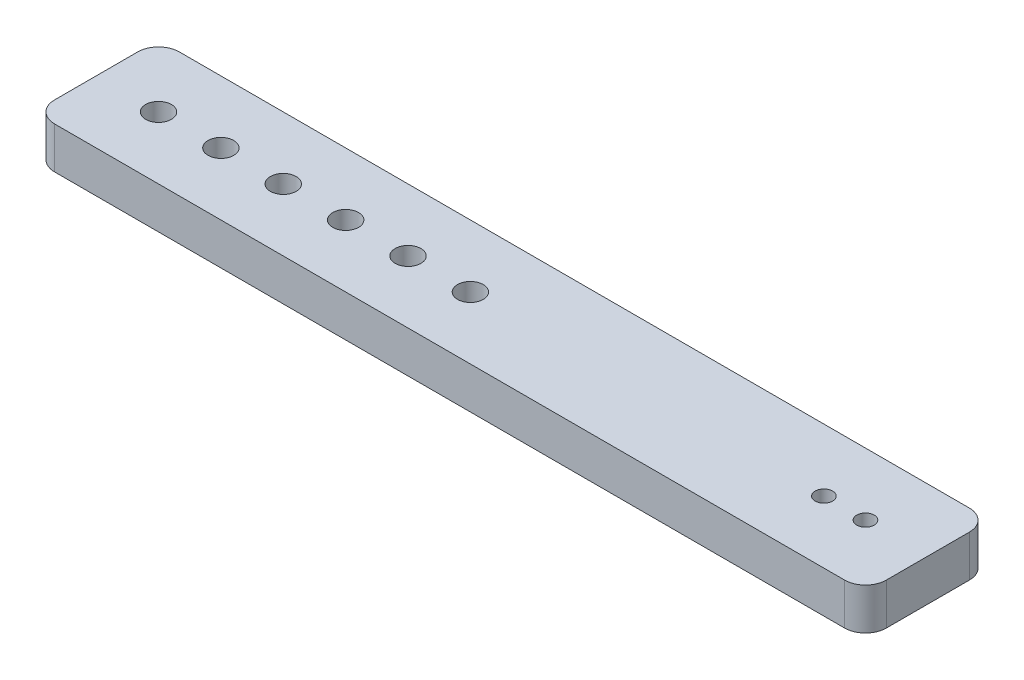
ISO-10303-21;
HEADER;
FILE_DESCRIPTION(('STEP AP214'),'2;1');
FILE_NAME('part.step','',(''),(''),'','','');
FILE_SCHEMA(('AUTOMOTIVE_DESIGN { 1 0 10303 214 1 1 1 1 }'));
ENDSEC;
DATA;
#1=APPLICATION_CONTEXT('core data for automotive mechanical design processes');
#2=APPLICATION_PROTOCOL_DEFINITION('international standard','automotive_design',2000,#1);
#3=PRODUCT_CONTEXT('',#1,'mechanical');
#4=PRODUCT('Part','Part','',(#3));
#5=PRODUCT_RELATED_PRODUCT_CATEGORY('part','',(#4));
#6=PRODUCT_DEFINITION_FORMATION('','',#4);
#7=PRODUCT_DEFINITION_CONTEXT('part definition',#1,'design');
#8=PRODUCT_DEFINITION('design','',#6,#7);
#9=PRODUCT_DEFINITION_SHAPE('','',#8);
#10=(LENGTH_UNIT() NAMED_UNIT(*) SI_UNIT(.MILLI.,.METRE.));
#11=(NAMED_UNIT(*) PLANE_ANGLE_UNIT() SI_UNIT($,.RADIAN.));
#12=(NAMED_UNIT(*) SI_UNIT($,.STERADIAN.) SOLID_ANGLE_UNIT());
#13=UNCERTAINTY_MEASURE_WITH_UNIT(LENGTH_MEASURE(1.E-05),#10,'distance_accuracy_value','');
#14=(GEOMETRIC_REPRESENTATION_CONTEXT(3) GLOBAL_UNCERTAINTY_ASSIGNED_CONTEXT((#13)) GLOBAL_UNIT_ASSIGNED_CONTEXT((#10,
#11,#12)) REPRESENTATION_CONTEXT('',''));
#15=CARTESIAN_POINT('',(0.,0.,0.));
#16=DIRECTION('',(0.,0.,1.));
#17=DIRECTION('',(1.,0.,0.));
#18=AXIS2_PLACEMENT_3D('',#15,#16,#17);
#19=CARTESIAN_POINT('',(-10.,0.,0.));
#20=DIRECTION('',(0.,1.,0.));
#21=DIRECTION('',(0.,0.,1.));
#22=AXIS2_PLACEMENT_3D('',#19,#20,#21);
#23=CYLINDRICAL_SURFACE('',#22,3.1);
#24=CARTESIAN_POINT('',(-10.,0.,0.));
#25=DIRECTION('',(0.,1.,0.));
#26=DIRECTION('',(0.,0.,1.));
#27=AXIS2_PLACEMENT_3D('',#24,#25,#26);
#28=CIRCLE('',#27,3.1);
#29=CARTESIAN_POINT('',(-10.,0.,3.1));
#30=VERTEX_POINT('',#29);
#31=EDGE_CURVE('E154',#30,#30,#28,.T.);
#32=ORIENTED_EDGE('',*,*,#31,.F.);
#33=EDGE_LOOP('',(#32));
#34=FACE_BOUND('',#33,.T.);
#35=CARTESIAN_POINT('',(-10.,10.,0.));
#36=DIRECTION('',(0.,1.,0.));
#37=DIRECTION('',(0.,0.,1.));
#38=AXIS2_PLACEMENT_3D('',#35,#36,#37);
#39=CIRCLE('',#38,3.1);
#40=CARTESIAN_POINT('',(-10.,10.,3.1));
#41=VERTEX_POINT('',#40);
#42=EDGE_CURVE('E157',#41,#41,#39,.T.);
#43=ORIENTED_EDGE('',*,*,#42,.T.);
#44=EDGE_LOOP('',(#43));
#45=FACE_BOUND('',#44,.T.);
#46=ADVANCED_FACE('F32',(#34,#45),#23,.F.);
#47=CARTESIAN_POINT('',(-25.,0.,0.));
#48=DIRECTION('',(0.,1.,0.));
#49=DIRECTION('',(0.,0.,1.));
#50=AXIS2_PLACEMENT_3D('',#47,#48,#49);
#51=CYLINDRICAL_SURFACE('',#50,3.1);
#52=CARTESIAN_POINT('',(-25.,0.,0.));
#53=DIRECTION('',(0.,1.,0.));
#54=DIRECTION('',(0.,0.,1.));
#55=AXIS2_PLACEMENT_3D('',#52,#53,#54);
#56=CIRCLE('',#55,3.1);
#57=CARTESIAN_POINT('',(-25.,0.,3.1));
#58=VERTEX_POINT('',#57);
#59=EDGE_CURVE('E148',#58,#58,#56,.T.);
#60=ORIENTED_EDGE('',*,*,#59,.F.);
#61=EDGE_LOOP('',(#60));
#62=FACE_BOUND('',#61,.T.);
#63=CARTESIAN_POINT('',(-25.,10.,0.));
#64=DIRECTION('',(0.,1.,0.));
#65=DIRECTION('',(0.,0.,1.));
#66=AXIS2_PLACEMENT_3D('',#63,#64,#65);
#67=CIRCLE('',#66,3.1);
#68=CARTESIAN_POINT('',(-25.,10.,3.1));
#69=VERTEX_POINT('',#68);
#70=EDGE_CURVE('E151',#69,#69,#67,.T.);
#71=ORIENTED_EDGE('',*,*,#70,.T.);
#72=EDGE_LOOP('',(#71));
#73=FACE_BOUND('',#72,.T.);
#74=ADVANCED_FACE('F255',(#62,#73),#51,.F.);
#75=CARTESIAN_POINT('',(-40.,0.,0.));
#76=DIRECTION('',(0.,1.,0.));
#77=DIRECTION('',(0.,0.,1.));
#78=AXIS2_PLACEMENT_3D('',#75,#76,#77);
#79=CYLINDRICAL_SURFACE('',#78,3.1);
#80=CARTESIAN_POINT('',(-40.,0.,0.));
#81=DIRECTION('',(0.,1.,0.));
#82=DIRECTION('',(0.,0.,1.));
#83=AXIS2_PLACEMENT_3D('',#80,#81,#82);
#84=CIRCLE('',#83,3.1);
#85=CARTESIAN_POINT('',(-40.,0.,3.1));
#86=VERTEX_POINT('',#85);
#87=EDGE_CURVE('E142',#86,#86,#84,.T.);
#88=ORIENTED_EDGE('',*,*,#87,.F.);
#89=EDGE_LOOP('',(#88));
#90=FACE_BOUND('',#89,.T.);
#91=CARTESIAN_POINT('',(-40.,10.,0.));
#92=DIRECTION('',(0.,1.,0.));
#93=DIRECTION('',(0.,0.,1.));
#94=AXIS2_PLACEMENT_3D('',#91,#92,#93);
#95=CIRCLE('',#94,3.1);
#96=CARTESIAN_POINT('',(-40.,10.,3.1));
#97=VERTEX_POINT('',#96);
#98=EDGE_CURVE('E145',#97,#97,#95,.T.);
#99=ORIENTED_EDGE('',*,*,#98,.T.);
#100=EDGE_LOOP('',(#99));
#101=FACE_BOUND('',#100,.T.);
#102=ADVANCED_FACE('F261',(#90,#101),#79,.F.);
#103=CARTESIAN_POINT('',(-55.,0.,0.));
#104=DIRECTION('',(0.,1.,0.));
#105=DIRECTION('',(0.,0.,1.));
#106=AXIS2_PLACEMENT_3D('',#103,#104,#105);
#107=CYLINDRICAL_SURFACE('',#106,3.1);
#108=CARTESIAN_POINT('',(-55.,0.,0.));
#109=DIRECTION('',(0.,1.,0.));
#110=DIRECTION('',(0.,0.,1.));
#111=AXIS2_PLACEMENT_3D('',#108,#109,#110);
#112=CIRCLE('',#111,3.1);
#113=CARTESIAN_POINT('',(-55.,0.,3.1));
#114=VERTEX_POINT('',#113);
#115=EDGE_CURVE('E136',#114,#114,#112,.T.);
#116=ORIENTED_EDGE('',*,*,#115,.F.);
#117=EDGE_LOOP('',(#116));
#118=FACE_BOUND('',#117,.T.);
#119=CARTESIAN_POINT('',(-55.,10.,0.));
#120=DIRECTION('',(0.,1.,0.));
#121=DIRECTION('',(0.,0.,1.));
#122=AXIS2_PLACEMENT_3D('',#119,#120,#121);
#123=CIRCLE('',#122,3.1);
#124=CARTESIAN_POINT('',(-55.,10.,3.1));
#125=VERTEX_POINT('',#124);
#126=EDGE_CURVE('E139',#125,#125,#123,.T.);
#127=ORIENTED_EDGE('',*,*,#126,.T.);
#128=EDGE_LOOP('',(#127));
#129=FACE_BOUND('',#128,.T.);
#130=ADVANCED_FACE('F295',(#118,#129),#107,.F.);
#131=CARTESIAN_POINT('',(-100.,10.,15.));
#132=DIRECTION('',(1.,0.,0.));
#133=DIRECTION('',(0.,0.,-1.));
#134=AXIS2_PLACEMENT_3D('',#131,#132,#133);
#135=PLANE('',#134);
#136=DIRECTION('',(0.,0.,1.));
#137=VECTOR('',#136,1.);
#138=CARTESIAN_POINT('',(-100.,10.,15.));
#139=LINE('',#138,#137);
#140=CARTESIAN_POINT('',(-100.,10.,-10.));
#141=VERTEX_POINT('',#140);
#142=CARTESIAN_POINT('',(-100.,10.,10.));
#143=VERTEX_POINT('',#142);
#144=EDGE_CURVE('E127',#141,#143,#139,.T.);
#145=ORIENTED_EDGE('',*,*,#144,.F.);
#146=DIRECTION('',(0.,-1.,0.));
#147=VECTOR('',#146,1.);
#148=CARTESIAN_POINT('',(-100.,10.,-10.));
#149=LINE('',#148,#147);
#150=CARTESIAN_POINT('',(-100.,0.,-10.));
#151=VERTEX_POINT('',#150);
#152=EDGE_CURVE('E11',#141,#151,#149,.T.);
#153=ORIENTED_EDGE('',*,*,#152,.T.);
#154=DIRECTION('',(0.,0.,1.));
#155=VECTOR('',#154,1.);
#156=CARTESIAN_POINT('',(-100.,0.,15.));
#157=LINE('',#156,#155);
#158=CARTESIAN_POINT('',(-100.,0.,10.));
#159=VERTEX_POINT('',#158);
#160=EDGE_CURVE('E183',#151,#159,#157,.T.);
#161=ORIENTED_EDGE('',*,*,#160,.T.);
#162=DIRECTION('',(0.,-1.,0.));
#163=VECTOR('',#162,1.);
#164=CARTESIAN_POINT('',(-100.,10.,10.));
#165=LINE('',#164,#163);
#166=EDGE_CURVE('E40',#159,#143,#165,.F.);
#167=ORIENTED_EDGE('',*,*,#166,.T.);
#168=EDGE_LOOP('',(#145,#153,#161,#167));
#169=FACE_BOUND('',#168,.T.);
#170=ADVANCED_FACE('F181',(#169),#135,.F.);
#171=CARTESIAN_POINT('',(100.,10.,15.));
#172=DIRECTION('',(0.,0.,-1.));
#173=DIRECTION('',(-1.,0.,0.));
#174=AXIS2_PLACEMENT_3D('',#171,#172,#173);
#175=PLANE('',#174);
#176=DIRECTION('',(1.,0.,0.));
#177=VECTOR('',#176,1.);
#178=CARTESIAN_POINT('',(100.,0.,15.));
#179=LINE('',#178,#177);
#180=CARTESIAN_POINT('',(-95.,0.,15.));
#181=VERTEX_POINT('',#180);
#182=CARTESIAN_POINT('',(95.,0.,15.));
#183=VERTEX_POINT('',#182);
#184=EDGE_CURVE('E132',#181,#183,#179,.T.);
#185=ORIENTED_EDGE('',*,*,#184,.T.);
#186=DIRECTION('',(0.,-1.,0.));
#187=VECTOR('',#186,1.);
#188=CARTESIAN_POINT('',(95.,10.,15.));
#189=LINE('',#188,#187);
#190=CARTESIAN_POINT('',(95.,10.,15.));
#191=VERTEX_POINT('',#190);
#192=EDGE_CURVE('E47',#183,#191,#189,.F.);
#193=ORIENTED_EDGE('',*,*,#192,.T.);
#194=DIRECTION('',(1.,0.,0.));
#195=VECTOR('',#194,1.);
#196=CARTESIAN_POINT('',(100.,10.,15.));
#197=LINE('',#196,#195);
#198=CARTESIAN_POINT('',(-95.,10.,15.));
#199=VERTEX_POINT('',#198);
#200=EDGE_CURVE('E130',#199,#191,#197,.T.);
#201=ORIENTED_EDGE('',*,*,#200,.F.);
#202=DIRECTION('',(0.,-1.,0.));
#203=VECTOR('',#202,1.);
#204=CARTESIAN_POINT('',(-95.,10.,15.));
#205=LINE('',#204,#203);
#206=EDGE_CURVE('E174',#199,#181,#205,.T.);
#207=ORIENTED_EDGE('',*,*,#206,.T.);
#208=EDGE_LOOP('',(#185,#193,#201,#207));
#209=FACE_BOUND('',#208,.T.);
#210=ADVANCED_FACE('F191',(#209),#175,.F.);
#211=CARTESIAN_POINT('',(100.,10.,15.));
#212=DIRECTION('',(-1.,0.,0.));
#213=DIRECTION('',(0.,0.,1.));
#214=AXIS2_PLACEMENT_3D('',#211,#212,#213);
#215=PLANE('',#214);
#216=DIRECTION('',(0.,0.,-1.));
#217=VECTOR('',#216,1.);
#218=CARTESIAN_POINT('',(100.,0.,15.));
#219=LINE('',#218,#217);
#220=CARTESIAN_POINT('',(100.,0.,10.));
#221=VERTEX_POINT('',#220);
#222=CARTESIAN_POINT('',(100.,0.,-10.));
#223=VERTEX_POINT('',#222);
#224=EDGE_CURVE('E128',#221,#223,#219,.T.);
#225=ORIENTED_EDGE('',*,*,#224,.T.);
#226=DIRECTION('',(0.,-1.,0.));
#227=VECTOR('',#226,1.);
#228=CARTESIAN_POINT('',(100.,10.,-10.));
#229=LINE('',#228,#227);
#230=CARTESIAN_POINT('',(100.,10.,-10.));
#231=VERTEX_POINT('',#230);
#232=EDGE_CURVE('E104',#223,#231,#229,.F.);
#233=ORIENTED_EDGE('',*,*,#232,.T.);
#234=DIRECTION('',(0.,0.,-1.));
#235=VECTOR('',#234,1.);
#236=CARTESIAN_POINT('',(100.,10.,15.));
#237=LINE('',#236,#235);
#238=CARTESIAN_POINT('',(100.,10.,10.));
#239=VERTEX_POINT('',#238);
#240=EDGE_CURVE('E196',#239,#231,#237,.T.);
#241=ORIENTED_EDGE('',*,*,#240,.F.);
#242=DIRECTION('',(0.,-1.,0.));
#243=VECTOR('',#242,1.);
#244=CARTESIAN_POINT('',(100.,10.,10.));
#245=LINE('',#244,#243);
#246=EDGE_CURVE('E109',#239,#221,#245,.T.);
#247=ORIENTED_EDGE('',*,*,#246,.T.);
#248=EDGE_LOOP('',(#225,#233,#241,#247));
#249=FACE_BOUND('',#248,.T.);
#250=ADVANCED_FACE('F283',(#249),#215,.F.);
#251=CARTESIAN_POINT('',(100.,10.,-15.));
#252=DIRECTION('',(0.,0.,1.));
#253=DIRECTION('',(1.,0.,0.));
#254=AXIS2_PLACEMENT_3D('',#251,#252,#253);
#255=PLANE('',#254);
#256=DIRECTION('',(-1.,0.,0.));
#257=VECTOR('',#256,1.);
#258=CARTESIAN_POINT('',(100.,10.,-15.));
#259=LINE('',#258,#257);
#260=CARTESIAN_POINT('',(95.,10.,-15.));
#261=VERTEX_POINT('',#260);
#262=CARTESIAN_POINT('',(-95.,10.,-15.));
#263=VERTEX_POINT('',#262);
#264=EDGE_CURVE('E119',#261,#263,#259,.T.);
#265=ORIENTED_EDGE('',*,*,#264,.F.);
#266=DIRECTION('',(0.,-1.,0.));
#267=VECTOR('',#266,1.);
#268=CARTESIAN_POINT('',(95.,10.,-15.));
#269=LINE('',#268,#267);
#270=CARTESIAN_POINT('',(95.,0.,-15.));
#271=VERTEX_POINT('',#270);
#272=EDGE_CURVE('E103',#261,#271,#269,.T.);
#273=ORIENTED_EDGE('',*,*,#272,.T.);
#274=DIRECTION('',(-1.,0.,0.));
#275=VECTOR('',#274,1.);
#276=CARTESIAN_POINT('',(100.,0.,-15.));
#277=LINE('',#276,#275);
#278=CARTESIAN_POINT('',(-95.,0.,-15.));
#279=VERTEX_POINT('',#278);
#280=EDGE_CURVE('E116',#271,#279,#277,.T.);
#281=ORIENTED_EDGE('',*,*,#280,.T.);
#282=DIRECTION('',(0.,-1.,0.));
#283=VECTOR('',#282,1.);
#284=CARTESIAN_POINT('',(-95.,10.,-15.));
#285=LINE('',#284,#283);
#286=EDGE_CURVE('E121',#279,#263,#285,.F.);
#287=ORIENTED_EDGE('',*,*,#286,.T.);
#288=EDGE_LOOP('',(#265,#273,#281,#287));
#289=FACE_BOUND('',#288,.T.);
#290=ADVANCED_FACE('F115',(#289),#255,.F.);
#291=CARTESIAN_POINT('',(0.,10.,0.));
#292=DIRECTION('',(0.,1.,0.));
#293=DIRECTION('',(0.,0.,1.));
#294=AXIS2_PLACEMENT_3D('',#291,#292,#293);
#295=PLANE('',#294);
#296=CARTESIAN_POINT('',(-70.,10.,0.));
#297=DIRECTION('',(0.,1.,0.));
#298=DIRECTION('',(0.,0.,1.));
#299=AXIS2_PLACEMENT_3D('',#296,#297,#298);
#300=CIRCLE('',#299,3.1);
#301=CARTESIAN_POINT('',(-70.,10.,3.1));
#302=VERTEX_POINT('',#301);
#303=EDGE_CURVE('E214',#302,#302,#300,.T.);
#304=ORIENTED_EDGE('',*,*,#303,.F.);
#305=EDGE_LOOP('',(#304));
#306=FACE_BOUND('',#305,.T.);
#307=CARTESIAN_POINT('',(-85.,10.,0.));
#308=DIRECTION('',(0.,1.,0.));
#309=DIRECTION('',(0.,0.,1.));
#310=AXIS2_PLACEMENT_3D('',#307,#308,#309);
#311=CIRCLE('',#310,3.1);
#312=CARTESIAN_POINT('',(-85.,10.,3.1));
#313=VERTEX_POINT('',#312);
#314=EDGE_CURVE('E211',#313,#313,#311,.T.);
#315=ORIENTED_EDGE('',*,*,#314,.F.);
#316=EDGE_LOOP('',(#315));
#317=FACE_BOUND('',#316,.T.);
#318=CARTESIAN_POINT('',(85.,10.,0.));
#319=DIRECTION('',(0.,1.,0.));
#320=DIRECTION('',(0.,0.,1.));
#321=AXIS2_PLACEMENT_3D('',#318,#319,#320);
#322=CIRCLE('',#321,2.1);
#323=CARTESIAN_POINT('',(85.,10.,2.1));
#324=VERTEX_POINT('',#323);
#325=EDGE_CURVE('E206',#324,#324,#322,.T.);
#326=ORIENTED_EDGE('',*,*,#325,.F.);
#327=EDGE_LOOP('',(#326));
#328=FACE_BOUND('',#327,.T.);
#329=CARTESIAN_POINT('',(75.,10.,0.));
#330=DIRECTION('',(0.,1.,0.));
#331=DIRECTION('',(0.,0.,1.));
#332=AXIS2_PLACEMENT_3D('',#329,#330,#331);
#333=CIRCLE('',#332,2.09999999999999);
#334=CARTESIAN_POINT('',(75.,10.,2.09999999999999));
#335=VERTEX_POINT('',#334);
#336=EDGE_CURVE('E199',#335,#335,#333,.T.);
#337=ORIENTED_EDGE('',*,*,#336,.F.);
#338=EDGE_LOOP('',(#337));
#339=FACE_BOUND('',#338,.T.);
#340=ORIENTED_EDGE('',*,*,#240,.T.);
#341=CARTESIAN_POINT('',(95.,10.,-10.));
#342=DIRECTION('',(0.,1.,0.));
#343=DIRECTION('',(0.,0.,1.));
#344=AXIS2_PLACEMENT_3D('',#341,#342,#343);
#345=CIRCLE('',#344,5.);
#346=EDGE_CURVE('E172',#231,#261,#345,.T.);
#347=ORIENTED_EDGE('',*,*,#346,.T.);
#348=ORIENTED_EDGE('',*,*,#264,.T.);
#349=CARTESIAN_POINT('',(-95.,10.,-10.));
#350=DIRECTION('',(0.,1.,0.));
#351=DIRECTION('',(0.,0.,1.));
#352=AXIS2_PLACEMENT_3D('',#349,#350,#351);
#353=CIRCLE('',#352,5.);
#354=EDGE_CURVE('E168',#263,#141,#353,.T.);
#355=ORIENTED_EDGE('',*,*,#354,.T.);
#356=ORIENTED_EDGE('',*,*,#144,.T.);
#357=CARTESIAN_POINT('',(-95.,10.,10.));
#358=DIRECTION('',(0.,1.,0.));
#359=DIRECTION('',(0.,0.,1.));
#360=AXIS2_PLACEMENT_3D('',#357,#358,#359);
#361=CIRCLE('',#360,5.);
#362=EDGE_CURVE('E54',#143,#199,#361,.T.);
#363=ORIENTED_EDGE('',*,*,#362,.T.);
#364=ORIENTED_EDGE('',*,*,#200,.T.);
#365=CARTESIAN_POINT('',(95.,10.,10.));
#366=DIRECTION('',(0.,1.,0.));
#367=DIRECTION('',(0.,0.,1.));
#368=AXIS2_PLACEMENT_3D('',#365,#366,#367);
#369=CIRCLE('',#368,5.);
#370=EDGE_CURVE('E170',#191,#239,#369,.T.);
#371=ORIENTED_EDGE('',*,*,#370,.T.);
#372=EDGE_LOOP('',(#340,#347,#348,#355,#356,#363,#364,#371));
#373=FACE_BOUND('',#372,.T.);
#374=ORIENTED_EDGE('',*,*,#126,.F.);
#375=EDGE_LOOP('',(#374));
#376=FACE_BOUND('',#375,.T.);
#377=ORIENTED_EDGE('',*,*,#98,.F.);
#378=EDGE_LOOP('',(#377));
#379=FACE_BOUND('',#378,.T.);
#380=ORIENTED_EDGE('',*,*,#70,.F.);
#381=EDGE_LOOP('',(#380));
#382=FACE_BOUND('',#381,.T.);
#383=ORIENTED_EDGE('',*,*,#42,.F.);
#384=EDGE_LOOP('',(#383));
#385=FACE_BOUND('',#384,.T.);
#386=ADVANCED_FACE('F186',(#306,#317,#328,#339,#373,#376,#379,#382,#385),#295,.T.);
#387=CARTESIAN_POINT('',(0.,0.,0.));
#388=DIRECTION('',(0.,1.,0.));
#389=DIRECTION('',(0.,0.,1.));
#390=AXIS2_PLACEMENT_3D('',#387,#388,#389);
#391=PLANE('',#390);
#392=CARTESIAN_POINT('',(-70.,0.,0.));
#393=DIRECTION('',(0.,1.,0.));
#394=DIRECTION('',(0.,0.,1.));
#395=AXIS2_PLACEMENT_3D('',#392,#393,#394);
#396=CIRCLE('',#395,3.1);
#397=CARTESIAN_POINT('',(-70.,0.,3.1));
#398=VERTEX_POINT('',#397);
#399=EDGE_CURVE('E219',#398,#398,#396,.T.);
#400=ORIENTED_EDGE('',*,*,#399,.T.);
#401=EDGE_LOOP('',(#400));
#402=FACE_BOUND('',#401,.T.);
#403=CARTESIAN_POINT('',(-85.,0.,0.));
#404=DIRECTION('',(0.,1.,0.));
#405=DIRECTION('',(0.,0.,1.));
#406=AXIS2_PLACEMENT_3D('',#403,#404,#405);
#407=CIRCLE('',#406,3.1);
#408=CARTESIAN_POINT('',(-85.,0.,3.1));
#409=VERTEX_POINT('',#408);
#410=EDGE_CURVE('E203',#409,#409,#407,.T.);
#411=ORIENTED_EDGE('',*,*,#410,.T.);
#412=EDGE_LOOP('',(#411));
#413=FACE_BOUND('',#412,.T.);
#414=CARTESIAN_POINT('',(85.,0.,0.));
#415=DIRECTION('',(0.,1.,0.));
#416=DIRECTION('',(0.,0.,1.));
#417=AXIS2_PLACEMENT_3D('',#414,#415,#416);
#418=CIRCLE('',#417,2.1);
#419=CARTESIAN_POINT('',(85.,0.,2.1));
#420=VERTEX_POINT('',#419);
#421=EDGE_CURVE('E192',#420,#420,#418,.T.);
#422=ORIENTED_EDGE('',*,*,#421,.T.);
#423=EDGE_LOOP('',(#422));
#424=FACE_BOUND('',#423,.T.);
#425=CARTESIAN_POINT('',(75.,0.,0.));
#426=DIRECTION('',(0.,1.,0.));
#427=DIRECTION('',(0.,0.,1.));
#428=AXIS2_PLACEMENT_3D('',#425,#426,#427);
#429=CIRCLE('',#428,2.09999999999999);
#430=CARTESIAN_POINT('',(75.,0.,2.09999999999999));
#431=VERTEX_POINT('',#430);
#432=EDGE_CURVE('E202',#431,#431,#429,.T.);
#433=ORIENTED_EDGE('',*,*,#432,.T.);
#434=EDGE_LOOP('',(#433));
#435=FACE_BOUND('',#434,.T.);
#436=ORIENTED_EDGE('',*,*,#280,.F.);
#437=CARTESIAN_POINT('',(95.,0.,-10.));
#438=DIRECTION('',(0.,1.,0.));
#439=DIRECTION('',(0.,0.,1.));
#440=AXIS2_PLACEMENT_3D('',#437,#438,#439);
#441=CIRCLE('',#440,5.);
#442=EDGE_CURVE('E99',#271,#223,#441,.F.);
#443=ORIENTED_EDGE('',*,*,#442,.T.);
#444=ORIENTED_EDGE('',*,*,#224,.F.);
#445=CARTESIAN_POINT('',(95.,0.,10.));
#446=DIRECTION('',(0.,1.,0.));
#447=DIRECTION('',(0.,0.,1.));
#448=AXIS2_PLACEMENT_3D('',#445,#446,#447);
#449=CIRCLE('',#448,5.);
#450=EDGE_CURVE('E110',#221,#183,#449,.F.);
#451=ORIENTED_EDGE('',*,*,#450,.T.);
#452=ORIENTED_EDGE('',*,*,#184,.F.);
#453=CARTESIAN_POINT('',(-95.,0.,10.));
#454=DIRECTION('',(0.,1.,0.));
#455=DIRECTION('',(0.,0.,1.));
#456=AXIS2_PLACEMENT_3D('',#453,#454,#455);
#457=CIRCLE('',#456,5.);
#458=EDGE_CURVE('E120',#181,#159,#457,.F.);
#459=ORIENTED_EDGE('',*,*,#458,.T.);
#460=ORIENTED_EDGE('',*,*,#160,.F.);
#461=CARTESIAN_POINT('',(-95.,0.,-10.));
#462=DIRECTION('',(0.,1.,0.));
#463=DIRECTION('',(0.,0.,1.));
#464=AXIS2_PLACEMENT_3D('',#461,#462,#463);
#465=CIRCLE('',#464,5.);
#466=EDGE_CURVE('E126',#151,#279,#465,.F.);
#467=ORIENTED_EDGE('',*,*,#466,.T.);
#468=EDGE_LOOP('',(#436,#443,#444,#451,#452,#459,#460,#467));
#469=FACE_BOUND('',#468,.T.);
#470=ORIENTED_EDGE('',*,*,#115,.T.);
#471=EDGE_LOOP('',(#470));
#472=FACE_BOUND('',#471,.T.);
#473=ORIENTED_EDGE('',*,*,#87,.T.);
#474=EDGE_LOOP('',(#473));
#475=FACE_BOUND('',#474,.T.);
#476=ORIENTED_EDGE('',*,*,#59,.T.);
#477=EDGE_LOOP('',(#476));
#478=FACE_BOUND('',#477,.T.);
#479=ORIENTED_EDGE('',*,*,#31,.T.);
#480=EDGE_LOOP('',(#479));
#481=FACE_BOUND('',#480,.T.);
#482=ADVANCED_FACE('F123',(#402,#413,#424,#435,#469,#472,#475,#478,#481),#391,.F.);
#483=CARTESIAN_POINT('',(75.,0.,0.));
#484=DIRECTION('',(0.,1.,0.));
#485=DIRECTION('',(0.,0.,1.));
#486=AXIS2_PLACEMENT_3D('',#483,#484,#485);
#487=CYLINDRICAL_SURFACE('',#486,2.09999999999999);
#488=ORIENTED_EDGE('',*,*,#432,.F.);
#489=EDGE_LOOP('',(#488));
#490=FACE_BOUND('',#489,.T.);
#491=ORIENTED_EDGE('',*,*,#336,.T.);
#492=EDGE_LOOP('',(#491));
#493=FACE_BOUND('',#492,.T.);
#494=ADVANCED_FACE('F241',(#490,#493),#487,.F.);
#495=CARTESIAN_POINT('',(85.,0.,0.));
#496=DIRECTION('',(0.,1.,0.));
#497=DIRECTION('',(0.,0.,1.));
#498=AXIS2_PLACEMENT_3D('',#495,#496,#497);
#499=CYLINDRICAL_SURFACE('',#498,2.1);
#500=ORIENTED_EDGE('',*,*,#421,.F.);
#501=EDGE_LOOP('',(#500));
#502=FACE_BOUND('',#501,.T.);
#503=ORIENTED_EDGE('',*,*,#325,.T.);
#504=EDGE_LOOP('',(#503));
#505=FACE_BOUND('',#504,.T.);
#506=ADVANCED_FACE('F243',(#502,#505),#499,.F.);
#507=CARTESIAN_POINT('',(-85.,0.,0.));
#508=DIRECTION('',(0.,1.,0.));
#509=DIRECTION('',(0.,0.,1.));
#510=AXIS2_PLACEMENT_3D('',#507,#508,#509);
#511=CYLINDRICAL_SURFACE('',#510,3.1);
#512=ORIENTED_EDGE('',*,*,#410,.F.);
#513=EDGE_LOOP('',(#512));
#514=FACE_BOUND('',#513,.T.);
#515=ORIENTED_EDGE('',*,*,#314,.T.);
#516=EDGE_LOOP('',(#515));
#517=FACE_BOUND('',#516,.T.);
#518=ADVANCED_FACE('F228',(#514,#517),#511,.F.);
#519=CARTESIAN_POINT('',(-70.,0.,0.));
#520=DIRECTION('',(0.,1.,0.));
#521=DIRECTION('',(0.,0.,1.));
#522=AXIS2_PLACEMENT_3D('',#519,#520,#521);
#523=CYLINDRICAL_SURFACE('',#522,3.1);
#524=ORIENTED_EDGE('',*,*,#399,.F.);
#525=EDGE_LOOP('',(#524));
#526=FACE_BOUND('',#525,.T.);
#527=ORIENTED_EDGE('',*,*,#303,.T.);
#528=EDGE_LOOP('',(#527));
#529=FACE_BOUND('',#528,.T.);
#530=ADVANCED_FACE('F225',(#526,#529),#523,.F.);
#531=CARTESIAN_POINT('',(95.,10.,-10.));
#532=DIRECTION('',(0.,-1.,0.));
#533=DIRECTION('',(0.,0.,-1.));
#534=AXIS2_PLACEMENT_3D('',#531,#532,#533);
#535=CYLINDRICAL_SURFACE('',#534,5.);
#536=ORIENTED_EDGE('',*,*,#346,.F.);
#537=ORIENTED_EDGE('',*,*,#232,.F.);
#538=ORIENTED_EDGE('',*,*,#442,.F.);
#539=ORIENTED_EDGE('',*,*,#272,.F.);
#540=EDGE_LOOP('',(#536,#537,#538,#539));
#541=FACE_BOUND('',#540,.T.);
#542=ADVANCED_FACE('F102',(#541),#535,.T.);
#543=CARTESIAN_POINT('',(95.,10.,10.));
#544=DIRECTION('',(0.,-1.,0.));
#545=DIRECTION('',(0.,0.,-1.));
#546=AXIS2_PLACEMENT_3D('',#543,#544,#545);
#547=CYLINDRICAL_SURFACE('',#546,5.);
#548=ORIENTED_EDGE('',*,*,#370,.F.);
#549=ORIENTED_EDGE('',*,*,#192,.F.);
#550=ORIENTED_EDGE('',*,*,#450,.F.);
#551=ORIENTED_EDGE('',*,*,#246,.F.);
#552=EDGE_LOOP('',(#548,#549,#550,#551));
#553=FACE_BOUND('',#552,.T.);
#554=ADVANCED_FACE('F270',(#553),#547,.T.);
#555=CARTESIAN_POINT('',(-95.,10.,-10.));
#556=DIRECTION('',(0.,-1.,0.));
#557=DIRECTION('',(0.,0.,-1.));
#558=AXIS2_PLACEMENT_3D('',#555,#556,#557);
#559=CYLINDRICAL_SURFACE('',#558,5.);
#560=ORIENTED_EDGE('',*,*,#354,.F.);
#561=ORIENTED_EDGE('',*,*,#286,.F.);
#562=ORIENTED_EDGE('',*,*,#466,.F.);
#563=ORIENTED_EDGE('',*,*,#152,.F.);
#564=EDGE_LOOP('',(#560,#561,#562,#563));
#565=FACE_BOUND('',#564,.T.);
#566=ADVANCED_FACE('F272',(#565),#559,.T.);
#567=CARTESIAN_POINT('',(-95.,10.,10.));
#568=DIRECTION('',(0.,-1.,0.));
#569=DIRECTION('',(0.,0.,-1.));
#570=AXIS2_PLACEMENT_3D('',#567,#568,#569);
#571=CYLINDRICAL_SURFACE('',#570,5.);
#572=ORIENTED_EDGE('',*,*,#362,.F.);
#573=ORIENTED_EDGE('',*,*,#166,.F.);
#574=ORIENTED_EDGE('',*,*,#458,.F.);
#575=ORIENTED_EDGE('',*,*,#206,.F.);
#576=EDGE_LOOP('',(#572,#573,#574,#575));
#577=FACE_BOUND('',#576,.T.);
#578=ADVANCED_FACE('F34',(#577),#571,.T.);
#579=CLOSED_SHELL('',(#46,#74,#102,#130,#170,#210,#250,#290,#386,#482,#494,#506,#518,#530,#542,
#554,#566,#578));
#580=MANIFOLD_SOLID_BREP('B2',#579);
#581=ADVANCED_BREP_SHAPE_REPRESENTATION('',(#18,#580),#14);
#582=SHAPE_DEFINITION_REPRESENTATION(#9,#581);
ENDSEC;
END-ISO-10303-21;
